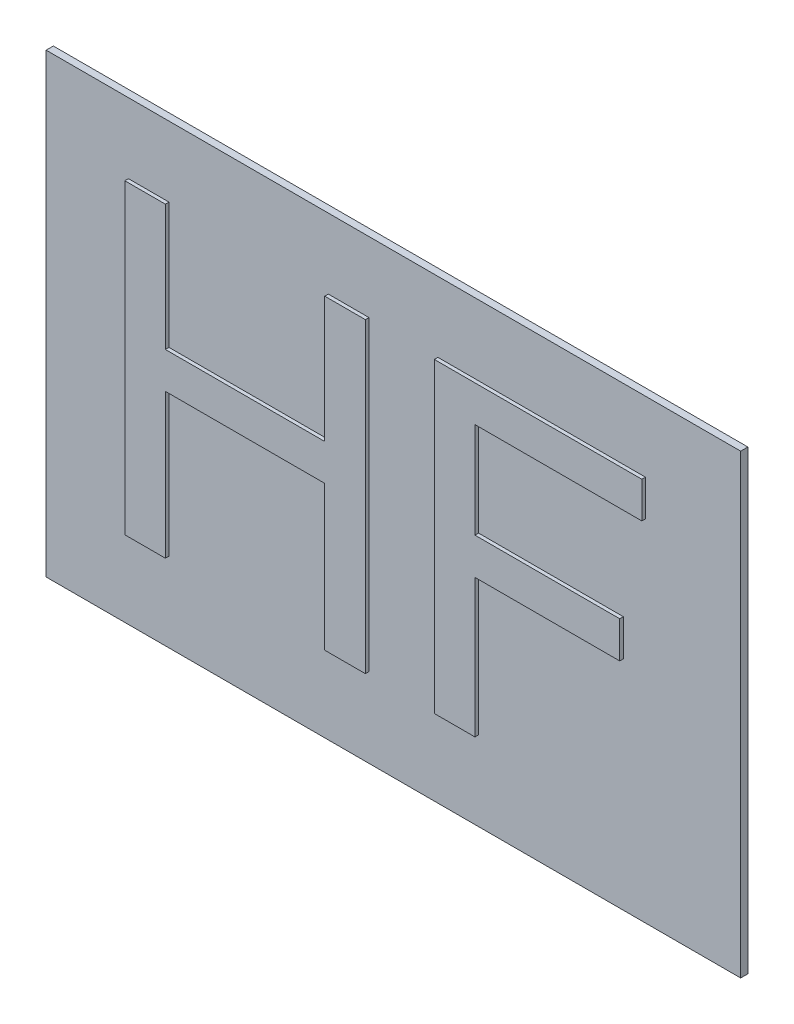
ISO-10303-21;
HEADER;
FILE_DESCRIPTION(('STEP AP214'),'2;1');
FILE_NAME('part.step','',(''),(''),'','','');
FILE_SCHEMA(('AUTOMOTIVE_DESIGN { 1 0 10303 214 1 1 1 1 }'));
ENDSEC;
DATA;
#1=APPLICATION_CONTEXT('core data for automotive mechanical design processes');
#2=APPLICATION_PROTOCOL_DEFINITION('international standard','automotive_design',2000,#1);
#3=PRODUCT_CONTEXT('',#1,'mechanical');
#4=PRODUCT('Part','Part','',(#3));
#5=PRODUCT_RELATED_PRODUCT_CATEGORY('part','',(#4));
#6=PRODUCT_DEFINITION_FORMATION('','',#4);
#7=PRODUCT_DEFINITION_CONTEXT('part definition',#1,'design');
#8=PRODUCT_DEFINITION('design','',#6,#7);
#9=PRODUCT_DEFINITION_SHAPE('','',#8);
#10=(LENGTH_UNIT() NAMED_UNIT(*) SI_UNIT(.MILLI.,.METRE.));
#11=(NAMED_UNIT(*) PLANE_ANGLE_UNIT() SI_UNIT($,.RADIAN.));
#12=(NAMED_UNIT(*) SI_UNIT($,.STERADIAN.) SOLID_ANGLE_UNIT());
#13=UNCERTAINTY_MEASURE_WITH_UNIT(LENGTH_MEASURE(1.E-05),#10,'distance_accuracy_value','');
#14=(GEOMETRIC_REPRESENTATION_CONTEXT(3) GLOBAL_UNCERTAINTY_ASSIGNED_CONTEXT((#13)) GLOBAL_UNIT_ASSIGNED_CONTEXT((#10,
#11,#12)) REPRESENTATION_CONTEXT('',''));
#15=CARTESIAN_POINT('',(0.,0.,0.));
#16=DIRECTION('',(0.,0.,1.));
#17=DIRECTION('',(1.,0.,0.));
#18=AXIS2_PLACEMENT_3D('',#15,#16,#17);
#19=CARTESIAN_POINT('',(1.8974,2.6195,0.05));
#20=DIRECTION('',(-1.,0.,0.));
#21=DIRECTION('',(0.,0.,1.));
#22=AXIS2_PLACEMENT_3D('',#19,#20,#21);
#23=PLANE('',#22);
#24=DIRECTION('',(0.,0.,1.));
#25=VECTOR('',#24,1.);
#26=CARTESIAN_POINT('',(1.8974,1.745,0.05));
#27=LINE('',#26,#25);
#28=CARTESIAN_POINT('',(1.8974,1.745,0.05));
#29=VERTEX_POINT('',#28);
#30=CARTESIAN_POINT('',(1.8974,1.745,0.075));
#31=VERTEX_POINT('',#30);
#32=EDGE_CURVE('E11',#29,#31,#27,.T.);
#33=ORIENTED_EDGE('',*,*,#32,.T.);
#34=DIRECTION('',(0.,-1.,0.));
#35=VECTOR('',#34,1.);
#36=CARTESIAN_POINT('',(1.8974,2.6195,0.075));
#37=LINE('',#36,#35);
#38=CARTESIAN_POINT('',(1.8974,2.6195,0.075));
#39=VERTEX_POINT('',#38);
#40=EDGE_CURVE('E313',#39,#31,#37,.T.);
#41=ORIENTED_EDGE('',*,*,#40,.F.);
#42=DIRECTION('',(0.,0.,1.));
#43=VECTOR('',#42,1.);
#44=CARTESIAN_POINT('',(1.8974,2.6195,0.05));
#45=LINE('',#44,#43);
#46=CARTESIAN_POINT('',(1.8974,2.6195,0.05));
#47=VERTEX_POINT('',#46);
#48=EDGE_CURVE('E333',#47,#39,#45,.T.);
#49=ORIENTED_EDGE('',*,*,#48,.F.);
#50=DIRECTION('',(0.,-1.,0.));
#51=VECTOR('',#50,1.);
#52=CARTESIAN_POINT('',(1.8974,2.6195,0.05));
#53=LINE('',#52,#51);
#54=EDGE_CURVE('E290',#47,#29,#53,.T.);
#55=ORIENTED_EDGE('',*,*,#54,.T.);
#56=EDGE_LOOP('',(#33,#41,#49,#55));
#57=FACE_BOUND('',#56,.T.);
#58=ADVANCED_FACE('F17',(#57),#23,.T.);
#59=CARTESIAN_POINT('',(1.8974,1.745,0.05));
#60=DIRECTION('',(0.,1.,0.));
#61=DIRECTION('',(1.,0.,0.));
#62=AXIS2_PLACEMENT_3D('',#59,#60,#61);
#63=PLANE('',#62);
#64=DIRECTION('',(0.,0.,1.));
#65=VECTOR('',#64,1.);
#66=CARTESIAN_POINT('',(0.7902,1.745,0.05));
#67=LINE('',#66,#65);
#68=CARTESIAN_POINT('',(0.7902,1.745,0.05));
#69=VERTEX_POINT('',#68);
#70=CARTESIAN_POINT('',(0.7902,1.745,0.075));
#71=VERTEX_POINT('',#70);
#72=EDGE_CURVE('E28',#69,#71,#67,.T.);
#73=ORIENTED_EDGE('',*,*,#72,.T.);
#74=DIRECTION('',(-1.,0.,0.));
#75=VECTOR('',#74,1.);
#76=CARTESIAN_POINT('',(1.8974,1.745,0.075));
#77=LINE('',#76,#75);
#78=EDGE_CURVE('E384',#31,#71,#77,.T.);
#79=ORIENTED_EDGE('',*,*,#78,.F.);
#80=ORIENTED_EDGE('',*,*,#32,.F.);
#81=DIRECTION('',(-1.,0.,0.));
#82=VECTOR('',#81,1.);
#83=CARTESIAN_POINT('',(1.8974,1.745,0.05));
#84=LINE('',#83,#82);
#85=EDGE_CURVE('E294',#29,#69,#84,.T.);
#86=ORIENTED_EDGE('',*,*,#85,.T.);
#87=EDGE_LOOP('',(#73,#79,#80,#86));
#88=FACE_BOUND('',#87,.T.);
#89=ADVANCED_FACE('F625',(#88),#63,.T.);
#90=CARTESIAN_POINT('',(0.7902,1.745,0.05));
#91=DIRECTION('',(1.,0.,0.));
#92=DIRECTION('',(0.,1.,0.));
#93=AXIS2_PLACEMENT_3D('',#90,#91,#92);
#94=PLANE('',#93);
#95=DIRECTION('',(0.,0.,1.));
#96=VECTOR('',#95,1.);
#97=CARTESIAN_POINT('',(0.7902,2.6195,0.05));
#98=LINE('',#97,#96);
#99=CARTESIAN_POINT('',(0.7902,2.6195,0.05));
#100=VERTEX_POINT('',#99);
#101=CARTESIAN_POINT('',(0.7902,2.6195,0.075));
#102=VERTEX_POINT('',#101);
#103=EDGE_CURVE('E326',#100,#102,#98,.T.);
#104=ORIENTED_EDGE('',*,*,#103,.T.);
#105=DIRECTION('',(0.,1.,0.));
#106=VECTOR('',#105,1.);
#107=CARTESIAN_POINT('',(0.7902,1.745,0.075));
#108=LINE('',#107,#106);
#109=EDGE_CURVE('E396',#71,#102,#108,.T.);
#110=ORIENTED_EDGE('',*,*,#109,.F.);
#111=ORIENTED_EDGE('',*,*,#72,.F.);
#112=DIRECTION('',(0.,1.,0.));
#113=VECTOR('',#112,1.);
#114=CARTESIAN_POINT('',(0.7902,1.745,0.05));
#115=LINE('',#114,#113);
#116=EDGE_CURVE('E276',#69,#100,#115,.T.);
#117=ORIENTED_EDGE('',*,*,#116,.T.);
#118=EDGE_LOOP('',(#104,#110,#111,#117));
#119=FACE_BOUND('',#118,.T.);
#120=ADVANCED_FACE('F513',(#119),#94,.T.);
#121=CARTESIAN_POINT('',(0.7902,2.6195,0.05));
#122=DIRECTION('',(0.,1.,0.));
#123=DIRECTION('',(1.,0.,0.));
#124=AXIS2_PLACEMENT_3D('',#121,#122,#123);
#125=PLANE('',#124);
#126=DIRECTION('',(0.,0.,1.));
#127=VECTOR('',#126,1.);
#128=CARTESIAN_POINT('',(0.5083,2.6195,0.05));
#129=LINE('',#128,#127);
#130=CARTESIAN_POINT('',(0.5083,2.6195,0.05));
#131=VERTEX_POINT('',#130);
#132=CARTESIAN_POINT('',(0.5083,2.6195,0.075));
#133=VERTEX_POINT('',#132);
#134=EDGE_CURVE('E438',#131,#133,#129,.T.);
#135=ORIENTED_EDGE('',*,*,#134,.T.);
#136=DIRECTION('',(-1.,0.,0.));
#137=VECTOR('',#136,1.);
#138=CARTESIAN_POINT('',(0.7902,2.6195,0.075));
#139=LINE('',#138,#137);
#140=EDGE_CURVE('E406',#102,#133,#139,.T.);
#141=ORIENTED_EDGE('',*,*,#140,.F.);
#142=ORIENTED_EDGE('',*,*,#103,.F.);
#143=DIRECTION('',(-1.,0.,0.));
#144=VECTOR('',#143,1.);
#145=CARTESIAN_POINT('',(0.7902,2.6195,0.05));
#146=LINE('',#145,#144);
#147=EDGE_CURVE('E273',#100,#131,#146,.T.);
#148=ORIENTED_EDGE('',*,*,#147,.T.);
#149=EDGE_LOOP('',(#135,#141,#142,#148));
#150=FACE_BOUND('',#149,.T.);
#151=ADVANCED_FACE('F503',(#150),#125,.T.);
#152=CARTESIAN_POINT('',(0.5083,2.6195,0.05));
#153=DIRECTION('',(-1.,0.,0.));
#154=DIRECTION('',(0.,0.,1.));
#155=AXIS2_PLACEMENT_3D('',#152,#153,#154);
#156=PLANE('',#155);
#157=DIRECTION('',(0.,0.,1.));
#158=VECTOR('',#157,1.);
#159=CARTESIAN_POINT('',(0.5083,0.4889,0.05));
#160=LINE('',#159,#158);
#161=CARTESIAN_POINT('',(0.5083,0.4889,0.05));
#162=VERTEX_POINT('',#161);
#163=CARTESIAN_POINT('',(0.5083,0.4889,0.075));
#164=VERTEX_POINT('',#163);
#165=EDGE_CURVE('E435',#162,#164,#160,.T.);
#166=ORIENTED_EDGE('',*,*,#165,.T.);
#167=DIRECTION('',(0.,-1.,0.));
#168=VECTOR('',#167,1.);
#169=CARTESIAN_POINT('',(0.5083,2.6195,0.075));
#170=LINE('',#169,#168);
#171=EDGE_CURVE('E402',#133,#164,#170,.T.);
#172=ORIENTED_EDGE('',*,*,#171,.F.);
#173=ORIENTED_EDGE('',*,*,#134,.F.);
#174=DIRECTION('',(0.,-1.,0.));
#175=VECTOR('',#174,1.);
#176=CARTESIAN_POINT('',(0.5083,2.6195,0.05));
#177=LINE('',#176,#175);
#178=EDGE_CURVE('E277',#131,#162,#177,.T.);
#179=ORIENTED_EDGE('',*,*,#178,.T.);
#180=EDGE_LOOP('',(#166,#172,#173,#179));
#181=FACE_BOUND('',#180,.T.);
#182=ADVANCED_FACE('F523',(#181),#156,.T.);
#183=CARTESIAN_POINT('',(0.5083,0.4889,0.05));
#184=DIRECTION('',(0.,-1.,0.));
#185=DIRECTION('',(0.,0.,-1.));
#186=AXIS2_PLACEMENT_3D('',#183,#184,#185);
#187=PLANE('',#186);
#188=DIRECTION('',(0.,0.,1.));
#189=VECTOR('',#188,1.);
#190=CARTESIAN_POINT('',(0.7902,0.4889,0.05));
#191=LINE('',#190,#189);
#192=CARTESIAN_POINT('',(0.7902,0.4889,0.05));
#193=VERTEX_POINT('',#192);
#194=CARTESIAN_POINT('',(0.7902,0.4889,0.075));
#195=VERTEX_POINT('',#194);
#196=EDGE_CURVE('E192',#193,#195,#191,.T.);
#197=ORIENTED_EDGE('',*,*,#196,.T.);
#198=DIRECTION('',(1.,0.,0.));
#199=VECTOR('',#198,1.);
#200=CARTESIAN_POINT('',(0.5083,0.4889,0.075));
#201=LINE('',#200,#199);
#202=EDGE_CURVE('E370',#164,#195,#201,.T.);
#203=ORIENTED_EDGE('',*,*,#202,.F.);
#204=ORIENTED_EDGE('',*,*,#165,.F.);
#205=DIRECTION('',(1.,0.,0.));
#206=VECTOR('',#205,1.);
#207=CARTESIAN_POINT('',(0.5083,0.4889,0.05));
#208=LINE('',#207,#206);
#209=EDGE_CURVE('E298',#162,#193,#208,.T.);
#210=ORIENTED_EDGE('',*,*,#209,.T.);
#211=EDGE_LOOP('',(#197,#203,#204,#210));
#212=FACE_BOUND('',#211,.T.);
#213=ADVANCED_FACE('F1259',(#212),#187,.T.);
#214=CARTESIAN_POINT('',(0.7902,0.4889,0.05));
#215=DIRECTION('',(1.,0.,0.));
#216=DIRECTION('',(0.,1.,0.));
#217=AXIS2_PLACEMENT_3D('',#214,#215,#216);
#218=PLANE('',#217);
#219=DIRECTION('',(0.,0.,1.));
#220=VECTOR('',#219,1.);
#221=CARTESIAN_POINT('',(0.7902,1.493,0.05));
#222=LINE('',#221,#220);
#223=CARTESIAN_POINT('',(0.7902,1.493,0.05));
#224=VERTEX_POINT('',#223);
#225=CARTESIAN_POINT('',(0.7902,1.493,0.075));
#226=VERTEX_POINT('',#225);
#227=EDGE_CURVE('E176',#224,#226,#222,.T.);
#228=ORIENTED_EDGE('',*,*,#227,.T.);
#229=DIRECTION('',(0.,1.,0.));
#230=VECTOR('',#229,1.);
#231=CARTESIAN_POINT('',(0.7902,0.4889,0.075));
#232=LINE('',#231,#230);
#233=EDGE_CURVE('E332',#195,#226,#232,.T.);
#234=ORIENTED_EDGE('',*,*,#233,.F.);
#235=ORIENTED_EDGE('',*,*,#196,.F.);
#236=DIRECTION('',(0.,1.,0.));
#237=VECTOR('',#236,1.);
#238=CARTESIAN_POINT('',(0.7902,0.4889,0.05));
#239=LINE('',#238,#237);
#240=EDGE_CURVE('E295',#193,#224,#239,.T.);
#241=ORIENTED_EDGE('',*,*,#240,.T.);
#242=EDGE_LOOP('',(#228,#234,#235,#241));
#243=FACE_BOUND('',#242,.T.);
#244=ADVANCED_FACE('F1269',(#243),#218,.T.);
#245=CARTESIAN_POINT('',(0.7902,1.493,0.05));
#246=DIRECTION('',(0.,-1.,0.));
#247=DIRECTION('',(0.,0.,-1.));
#248=AXIS2_PLACEMENT_3D('',#245,#246,#247);
#249=PLANE('',#248);
#250=DIRECTION('',(0.,0.,1.));
#251=VECTOR('',#250,1.);
#252=CARTESIAN_POINT('',(1.8974,1.493,0.05));
#253=LINE('',#252,#251);
#254=CARTESIAN_POINT('',(1.8974,1.493,0.05));
#255=VERTEX_POINT('',#254);
#256=CARTESIAN_POINT('',(1.8974,1.493,0.075));
#257=VERTEX_POINT('',#256);
#258=EDGE_CURVE('E363',#255,#257,#253,.T.);
#259=ORIENTED_EDGE('',*,*,#258,.T.);
#260=DIRECTION('',(1.,0.,0.));
#261=VECTOR('',#260,1.);
#262=CARTESIAN_POINT('',(0.7902,1.493,0.075));
#263=LINE('',#262,#261);
#264=EDGE_CURVE('E327',#226,#257,#263,.T.);
#265=ORIENTED_EDGE('',*,*,#264,.F.);
#266=ORIENTED_EDGE('',*,*,#227,.F.);
#267=DIRECTION('',(1.,0.,0.));
#268=VECTOR('',#267,1.);
#269=CARTESIAN_POINT('',(0.7902,1.493,0.05));
#270=LINE('',#269,#268);
#271=EDGE_CURVE('E299',#224,#255,#270,.T.);
#272=ORIENTED_EDGE('',*,*,#271,.T.);
#273=EDGE_LOOP('',(#259,#265,#266,#272));
#274=FACE_BOUND('',#273,.T.);
#275=ADVANCED_FACE('F1280',(#274),#249,.T.);
#276=CARTESIAN_POINT('',(1.8974,1.493,0.05));
#277=DIRECTION('',(-1.,0.,0.));
#278=DIRECTION('',(0.,0.,1.));
#279=AXIS2_PLACEMENT_3D('',#276,#277,#278);
#280=PLANE('',#279);
#281=DIRECTION('',(0.,0.,1.));
#282=VECTOR('',#281,1.);
#283=CARTESIAN_POINT('',(1.8974,0.4889,0.05));
#284=LINE('',#283,#282);
#285=CARTESIAN_POINT('',(1.8974,0.4889,0.05));
#286=VERTEX_POINT('',#285);
#287=CARTESIAN_POINT('',(1.8974,0.4889,0.075));
#288=VERTEX_POINT('',#287);
#289=EDGE_CURVE('E373',#286,#288,#284,.T.);
#290=ORIENTED_EDGE('',*,*,#289,.T.);
#291=DIRECTION('',(0.,-1.,0.));
#292=VECTOR('',#291,1.);
#293=CARTESIAN_POINT('',(1.8974,1.493,0.075));
#294=LINE('',#293,#292);
#295=EDGE_CURVE('E331',#257,#288,#294,.T.);
#296=ORIENTED_EDGE('',*,*,#295,.F.);
#297=ORIENTED_EDGE('',*,*,#258,.F.);
#298=DIRECTION('',(0.,-1.,0.));
#299=VECTOR('',#298,1.);
#300=CARTESIAN_POINT('',(1.8974,1.493,0.05));
#301=LINE('',#300,#299);
#302=EDGE_CURVE('E305',#255,#286,#301,.T.);
#303=ORIENTED_EDGE('',*,*,#302,.T.);
#304=EDGE_LOOP('',(#290,#296,#297,#303));
#305=FACE_BOUND('',#304,.T.);
#306=ADVANCED_FACE('F1290',(#305),#280,.T.);
#307=CARTESIAN_POINT('',(1.8974,0.4889,0.05));
#308=DIRECTION('',(0.,-1.,0.));
#309=DIRECTION('',(0.,0.,-1.));
#310=AXIS2_PLACEMENT_3D('',#307,#308,#309);
#311=PLANE('',#310);
#312=DIRECTION('',(0.,0.,1.));
#313=VECTOR('',#312,1.);
#314=CARTESIAN_POINT('',(2.1798,0.4889,0.05));
#315=LINE('',#314,#313);
#316=CARTESIAN_POINT('',(2.1798,0.4889,0.05));
#317=VERTEX_POINT('',#316);
#318=CARTESIAN_POINT('',(2.1798,0.4889,0.075));
#319=VERTEX_POINT('',#318);
#320=EDGE_CURVE('E371',#317,#319,#315,.T.);
#321=ORIENTED_EDGE('',*,*,#320,.T.);
#322=DIRECTION('',(1.,0.,0.));
#323=VECTOR('',#322,1.);
#324=CARTESIAN_POINT('',(1.8974,0.4889,0.075));
#325=LINE('',#324,#323);
#326=EDGE_CURVE('E445',#288,#319,#325,.T.);
#327=ORIENTED_EDGE('',*,*,#326,.F.);
#328=ORIENTED_EDGE('',*,*,#289,.F.);
#329=DIRECTION('',(1.,0.,0.));
#330=VECTOR('',#329,1.);
#331=CARTESIAN_POINT('',(1.8974,0.4889,0.05));
#332=LINE('',#331,#330);
#333=EDGE_CURVE('E309',#286,#317,#332,.T.);
#334=ORIENTED_EDGE('',*,*,#333,.T.);
#335=EDGE_LOOP('',(#321,#327,#328,#334));
#336=FACE_BOUND('',#335,.T.);
#337=ADVANCED_FACE('F19',(#336),#311,.T.);
#338=CARTESIAN_POINT('',(2.1798,0.4889,0.05));
#339=DIRECTION('',(1.,0.,0.));
#340=DIRECTION('',(0.,1.,0.));
#341=AXIS2_PLACEMENT_3D('',#338,#339,#340);
#342=PLANE('',#341);
#343=DIRECTION('',(0.,0.,1.));
#344=VECTOR('',#343,1.);
#345=CARTESIAN_POINT('',(2.1798,2.6195,0.05));
#346=LINE('',#345,#344);
#347=CARTESIAN_POINT('',(2.1798,2.6195,0.05));
#348=VERTEX_POINT('',#347);
#349=CARTESIAN_POINT('',(2.1798,2.6195,0.075));
#350=VERTEX_POINT('',#349);
#351=EDGE_CURVE('E42',#348,#350,#346,.T.);
#352=ORIENTED_EDGE('',*,*,#351,.T.);
#353=DIRECTION('',(0.,1.,0.));
#354=VECTOR('',#353,1.);
#355=CARTESIAN_POINT('',(2.1798,0.4889,0.075));
#356=LINE('',#355,#354);
#357=EDGE_CURVE('E271',#319,#350,#356,.T.);
#358=ORIENTED_EDGE('',*,*,#357,.F.);
#359=ORIENTED_EDGE('',*,*,#320,.F.);
#360=DIRECTION('',(0.,1.,0.));
#361=VECTOR('',#360,1.);
#362=CARTESIAN_POINT('',(2.1798,0.4889,0.05));
#363=LINE('',#362,#361);
#364=EDGE_CURVE('E341',#317,#348,#363,.T.);
#365=ORIENTED_EDGE('',*,*,#364,.T.);
#366=EDGE_LOOP('',(#352,#358,#359,#365));
#367=FACE_BOUND('',#366,.T.);
#368=ADVANCED_FACE('F559',(#367),#342,.T.);
#369=CARTESIAN_POINT('',(2.1798,2.6195,0.05));
#370=DIRECTION('',(0.,1.,0.));
#371=DIRECTION('',(1.,0.,0.));
#372=AXIS2_PLACEMENT_3D('',#369,#370,#371);
#373=PLANE('',#372);
#374=ORIENTED_EDGE('',*,*,#48,.T.);
#375=DIRECTION('',(-1.,0.,0.));
#376=VECTOR('',#375,1.);
#377=CARTESIAN_POINT('',(2.1798,2.6195,0.075));
#378=LINE('',#377,#376);
#379=EDGE_CURVE('E336',#350,#39,#378,.T.);
#380=ORIENTED_EDGE('',*,*,#379,.F.);
#381=ORIENTED_EDGE('',*,*,#351,.F.);
#382=DIRECTION('',(-1.,0.,0.));
#383=VECTOR('',#382,1.);
#384=CARTESIAN_POINT('',(2.1798,2.6195,0.05));
#385=LINE('',#384,#383);
#386=EDGE_CURVE('E283',#348,#47,#385,.T.);
#387=ORIENTED_EDGE('',*,*,#386,.T.);
#388=EDGE_LOOP('',(#374,#380,#381,#387));
#389=FACE_BOUND('',#388,.T.);
#390=ADVANCED_FACE('F1207',(#389),#373,.T.);
#391=CARTESIAN_POINT('',(0.,0.,0.075));
#392=DIRECTION('',(0.,0.,1.));
#393=DIRECTION('',(1.,0.,0.));
#394=AXIS2_PLACEMENT_3D('',#391,#392,#393);
#395=PLANE('',#394);
#396=ORIENTED_EDGE('',*,*,#40,.T.);
#397=ORIENTED_EDGE('',*,*,#78,.T.);
#398=ORIENTED_EDGE('',*,*,#109,.T.);
#399=ORIENTED_EDGE('',*,*,#140,.T.);
#400=ORIENTED_EDGE('',*,*,#171,.T.);
#401=ORIENTED_EDGE('',*,*,#202,.T.);
#402=ORIENTED_EDGE('',*,*,#233,.T.);
#403=ORIENTED_EDGE('',*,*,#264,.T.);
#404=ORIENTED_EDGE('',*,*,#295,.T.);
#405=ORIENTED_EDGE('',*,*,#326,.T.);
#406=ORIENTED_EDGE('',*,*,#357,.T.);
#407=ORIENTED_EDGE('',*,*,#379,.T.);
#408=EDGE_LOOP('',(#396,#397,#398,#399,#400,#401,#402,#403,#404,#405,#406,#407));
#409=FACE_BOUND('',#408,.T.);
#410=ADVANCED_FACE('F556',(#409),#395,.T.);
#411=CARTESIAN_POINT('',(0.,0.,0.075));
#412=DIRECTION('',(0.,0.,1.));
#413=DIRECTION('',(1.,0.,0.));
#414=AXIS2_PLACEMENT_3D('',#411,#412,#413);
#415=PLANE('',#414);
#416=DIRECTION('',(1.,0.,0.));
#417=VECTOR('',#416,1.);
#418=CARTESIAN_POINT('',(2.9413,1.4491,0.075));
#419=LINE('',#418,#417);
#420=CARTESIAN_POINT('',(2.9413,1.4491,0.075));
#421=VERTEX_POINT('',#420);
#422=CARTESIAN_POINT('',(3.9469,1.4491,0.075));
#423=VERTEX_POINT('',#422);
#424=EDGE_CURVE('E310',#421,#423,#419,.T.);
#425=ORIENTED_EDGE('',*,*,#424,.T.);
#426=DIRECTION('',(0.,1.,0.));
#427=VECTOR('',#426,1.);
#428=CARTESIAN_POINT('',(3.9469,1.4491,0.075));
#429=LINE('',#428,#427);
#430=CARTESIAN_POINT('',(3.9469,1.7031,0.075));
#431=VERTEX_POINT('',#430);
#432=EDGE_CURVE('E323',#423,#431,#429,.T.);
#433=ORIENTED_EDGE('',*,*,#432,.T.);
#434=DIRECTION('',(-1.,0.,0.));
#435=VECTOR('',#434,1.);
#436=CARTESIAN_POINT('',(3.9469,1.7031,0.075));
#437=LINE('',#436,#435);
#438=CARTESIAN_POINT('',(2.9413,1.7031,0.075));
#439=VERTEX_POINT('',#438);
#440=EDGE_CURVE('E434',#431,#439,#437,.T.);
#441=ORIENTED_EDGE('',*,*,#440,.T.);
#442=DIRECTION('',(0.,1.,0.));
#443=VECTOR('',#442,1.);
#444=CARTESIAN_POINT('',(2.9413,1.7031,0.075));
#445=LINE('',#444,#443);
#446=CARTESIAN_POINT('',(2.9413,2.3686,0.075));
#447=VERTEX_POINT('',#446);
#448=EDGE_CURVE('E240',#439,#447,#445,.T.);
#449=ORIENTED_EDGE('',*,*,#448,.T.);
#450=DIRECTION('',(1.,0.,0.));
#451=VECTOR('',#450,1.);
#452=CARTESIAN_POINT('',(2.9413,2.3686,0.075));
#453=LINE('',#452,#451);
#454=CARTESIAN_POINT('',(4.1008,2.3686,0.075));
#455=VERTEX_POINT('',#454);
#456=EDGE_CURVE('E233',#447,#455,#453,.T.);
#457=ORIENTED_EDGE('',*,*,#456,.T.);
#458=DIRECTION('',(0.,1.,0.));
#459=VECTOR('',#458,1.);
#460=CARTESIAN_POINT('',(4.1008,2.3686,0.075));
#461=LINE('',#460,#459);
#462=CARTESIAN_POINT('',(4.1008,2.6195,0.075));
#463=VERTEX_POINT('',#462);
#464=EDGE_CURVE('E237',#455,#463,#461,.T.);
#465=ORIENTED_EDGE('',*,*,#464,.T.);
#466=DIRECTION('',(-1.,0.,0.));
#467=VECTOR('',#466,1.);
#468=CARTESIAN_POINT('',(4.1008,2.6195,0.075));
#469=LINE('',#468,#467);
#470=CARTESIAN_POINT('',(2.6586,2.6195,0.075));
#471=VERTEX_POINT('',#470);
#472=EDGE_CURVE('E267',#463,#471,#469,.T.);
#473=ORIENTED_EDGE('',*,*,#472,.T.);
#474=DIRECTION('',(0.,-1.,0.));
#475=VECTOR('',#474,1.);
#476=CARTESIAN_POINT('',(2.6586,2.6195,0.075));
#477=LINE('',#476,#475);
#478=CARTESIAN_POINT('',(2.6586,0.4889,0.075));
#479=VERTEX_POINT('',#478);
#480=EDGE_CURVE('E304',#471,#479,#477,.T.);
#481=ORIENTED_EDGE('',*,*,#480,.T.);
#482=DIRECTION('',(1.,0.,0.));
#483=VECTOR('',#482,1.);
#484=CARTESIAN_POINT('',(2.6586,0.4889,0.075));
#485=LINE('',#484,#483);
#486=CARTESIAN_POINT('',(2.9413,0.4889,0.075));
#487=VERTEX_POINT('',#486);
#488=EDGE_CURVE('E385',#479,#487,#485,.T.);
#489=ORIENTED_EDGE('',*,*,#488,.T.);
#490=DIRECTION('',(0.,1.,0.));
#491=VECTOR('',#490,1.);
#492=CARTESIAN_POINT('',(2.9413,0.4889,0.075));
#493=LINE('',#492,#491);
#494=EDGE_CURVE('E282',#487,#421,#493,.T.);
#495=ORIENTED_EDGE('',*,*,#494,.T.);
#496=EDGE_LOOP('',(#425,#433,#441,#449,#457,#465,#473,#481,#489,#495));
#497=FACE_BOUND('',#496,.T.);
#498=ADVANCED_FACE('F235',(#497),#415,.T.);
#499=CARTESIAN_POINT('',(2.9413,1.4491,0.05));
#500=DIRECTION('',(0.,-1.,0.));
#501=DIRECTION('',(0.,0.,-1.));
#502=AXIS2_PLACEMENT_3D('',#499,#500,#501);
#503=PLANE('',#502);
#504=DIRECTION('',(0.,0.,1.));
#505=VECTOR('',#504,1.);
#506=CARTESIAN_POINT('',(3.9469,1.4491,0.05));
#507=LINE('',#506,#505);
#508=CARTESIAN_POINT('',(3.9469,1.4491,0.05));
#509=VERTEX_POINT('',#508);
#510=EDGE_CURVE('E314',#509,#423,#507,.T.);
#511=ORIENTED_EDGE('',*,*,#510,.T.);
#512=ORIENTED_EDGE('',*,*,#424,.F.);
#513=DIRECTION('',(0.,0.,1.));
#514=VECTOR('',#513,1.);
#515=CARTESIAN_POINT('',(2.9413,1.4491,0.05));
#516=LINE('',#515,#514);
#517=CARTESIAN_POINT('',(2.9413,1.4491,0.05));
#518=VERTEX_POINT('',#517);
#519=EDGE_CURVE('E278',#518,#421,#516,.T.);
#520=ORIENTED_EDGE('',*,*,#519,.F.);
#521=DIRECTION('',(1.,0.,0.));
#522=VECTOR('',#521,1.);
#523=CARTESIAN_POINT('',(2.9413,1.4491,0.05));
#524=LINE('',#523,#522);
#525=EDGE_CURVE('E342',#518,#509,#524,.T.);
#526=ORIENTED_EDGE('',*,*,#525,.T.);
#527=EDGE_LOOP('',(#511,#512,#520,#526));
#528=FACE_BOUND('',#527,.T.);
#529=ADVANCED_FACE('F467',(#528),#503,.T.);
#530=CARTESIAN_POINT('',(3.9469,1.4491,0.05));
#531=DIRECTION('',(1.,0.,0.));
#532=DIRECTION('',(0.,1.,0.));
#533=AXIS2_PLACEMENT_3D('',#530,#531,#532);
#534=PLANE('',#533);
#535=DIRECTION('',(0.,0.,1.));
#536=VECTOR('',#535,1.);
#537=CARTESIAN_POINT('',(3.9469,1.7031,0.05));
#538=LINE('',#537,#536);
#539=CARTESIAN_POINT('',(3.9469,1.7031,0.05));
#540=VERTEX_POINT('',#539);
#541=EDGE_CURVE('E425',#540,#431,#538,.T.);
#542=ORIENTED_EDGE('',*,*,#541,.T.);
#543=ORIENTED_EDGE('',*,*,#432,.F.);
#544=ORIENTED_EDGE('',*,*,#510,.F.);
#545=DIRECTION('',(0.,1.,0.));
#546=VECTOR('',#545,1.);
#547=CARTESIAN_POINT('',(3.9469,1.4491,0.05));
#548=LINE('',#547,#546);
#549=EDGE_CURVE('E378',#509,#540,#548,.T.);
#550=ORIENTED_EDGE('',*,*,#549,.T.);
#551=EDGE_LOOP('',(#542,#543,#544,#550));
#552=FACE_BOUND('',#551,.T.);
#553=ADVANCED_FACE('F479',(#552),#534,.T.);
#554=CARTESIAN_POINT('',(3.9469,1.7031,0.05));
#555=DIRECTION('',(0.,1.,0.));
#556=DIRECTION('',(1.,0.,0.));
#557=AXIS2_PLACEMENT_3D('',#554,#555,#556);
#558=PLANE('',#557);
#559=DIRECTION('',(0.,0.,1.));
#560=VECTOR('',#559,1.);
#561=CARTESIAN_POINT('',(2.9413,1.7031,0.05));
#562=LINE('',#561,#560);
#563=CARTESIAN_POINT('',(2.9413,1.7031,0.05));
#564=VERTEX_POINT('',#563);
#565=EDGE_CURVE('E392',#564,#439,#562,.T.);
#566=ORIENTED_EDGE('',*,*,#565,.T.);
#567=ORIENTED_EDGE('',*,*,#440,.F.);
#568=ORIENTED_EDGE('',*,*,#541,.F.);
#569=DIRECTION('',(-1.,0.,0.));
#570=VECTOR('',#569,1.);
#571=CARTESIAN_POINT('',(3.9469,1.7031,0.05));
#572=LINE('',#571,#570);
#573=EDGE_CURVE('E375',#540,#564,#572,.T.);
#574=ORIENTED_EDGE('',*,*,#573,.T.);
#575=EDGE_LOOP('',(#566,#567,#568,#574));
#576=FACE_BOUND('',#575,.T.);
#577=ADVANCED_FACE('F1336',(#576),#558,.T.);
#578=CARTESIAN_POINT('',(2.9413,1.7031,0.05));
#579=DIRECTION('',(1.,0.,0.));
#580=DIRECTION('',(0.,1.,0.));
#581=AXIS2_PLACEMENT_3D('',#578,#579,#580);
#582=PLANE('',#581);
#583=DIRECTION('',(0.,0.,1.));
#584=VECTOR('',#583,1.);
#585=CARTESIAN_POINT('',(2.9413,2.3686,0.05));
#586=LINE('',#585,#584);
#587=CARTESIAN_POINT('',(2.9413,2.3686,0.05));
#588=VERTEX_POINT('',#587);
#589=EDGE_CURVE('E244',#588,#447,#586,.T.);
#590=ORIENTED_EDGE('',*,*,#589,.T.);
#591=ORIENTED_EDGE('',*,*,#448,.F.);
#592=ORIENTED_EDGE('',*,*,#565,.F.);
#593=DIRECTION('',(0.,1.,0.));
#594=VECTOR('',#593,1.);
#595=CARTESIAN_POINT('',(2.9413,1.7031,0.05));
#596=LINE('',#595,#594);
#597=EDGE_CURVE('E379',#564,#588,#596,.T.);
#598=ORIENTED_EDGE('',*,*,#597,.T.);
#599=EDGE_LOOP('',(#590,#591,#592,#598));
#600=FACE_BOUND('',#599,.T.);
#601=ADVANCED_FACE('F599',(#600),#582,.T.);
#602=CARTESIAN_POINT('',(2.9413,2.3686,0.05));
#603=DIRECTION('',(0.,-1.,0.));
#604=DIRECTION('',(0.,0.,-1.));
#605=AXIS2_PLACEMENT_3D('',#602,#603,#604);
#606=PLANE('',#605);
#607=DIRECTION('',(0.,0.,1.));
#608=VECTOR('',#607,1.);
#609=CARTESIAN_POINT('',(4.1008,2.3686,0.05));
#610=LINE('',#609,#608);
#611=CARTESIAN_POINT('',(4.1008,2.3686,0.05));
#612=VERTEX_POINT('',#611);
#613=EDGE_CURVE('E245',#612,#455,#610,.T.);
#614=ORIENTED_EDGE('',*,*,#613,.T.);
#615=ORIENTED_EDGE('',*,*,#456,.F.);
#616=ORIENTED_EDGE('',*,*,#589,.F.);
#617=DIRECTION('',(1.,0.,0.));
#618=VECTOR('',#617,1.);
#619=CARTESIAN_POINT('',(2.9413,2.3686,0.05));
#620=LINE('',#619,#618);
#621=EDGE_CURVE('E250',#588,#612,#620,.T.);
#622=ORIENTED_EDGE('',*,*,#621,.T.);
#623=EDGE_LOOP('',(#614,#615,#616,#622));
#624=FACE_BOUND('',#623,.T.);
#625=ADVANCED_FACE('F248',(#624),#606,.T.);
#626=CARTESIAN_POINT('',(4.1008,2.3686,0.05));
#627=DIRECTION('',(1.,0.,0.));
#628=DIRECTION('',(0.,1.,0.));
#629=AXIS2_PLACEMENT_3D('',#626,#627,#628);
#630=PLANE('',#629);
#631=DIRECTION('',(0.,0.,1.));
#632=VECTOR('',#631,1.);
#633=CARTESIAN_POINT('',(4.1008,2.6195,0.05));
#634=LINE('',#633,#632);
#635=CARTESIAN_POINT('',(4.1008,2.6195,0.05));
#636=VERTEX_POINT('',#635);
#637=EDGE_CURVE('E257',#636,#463,#634,.T.);
#638=ORIENTED_EDGE('',*,*,#637,.T.);
#639=ORIENTED_EDGE('',*,*,#464,.F.);
#640=ORIENTED_EDGE('',*,*,#613,.F.);
#641=DIRECTION('',(0.,1.,0.));
#642=VECTOR('',#641,1.);
#643=CARTESIAN_POINT('',(4.1008,2.3686,0.05));
#644=LINE('',#643,#642);
#645=EDGE_CURVE('E413',#612,#636,#644,.T.);
#646=ORIENTED_EDGE('',*,*,#645,.T.);
#647=EDGE_LOOP('',(#638,#639,#640,#646));
#648=FACE_BOUND('',#647,.T.);
#649=ADVANCED_FACE('F256',(#648),#630,.T.);
#650=CARTESIAN_POINT('',(4.1008,2.6195,0.05));
#651=DIRECTION('',(0.,1.,0.));
#652=DIRECTION('',(1.,0.,0.));
#653=AXIS2_PLACEMENT_3D('',#650,#651,#652);
#654=PLANE('',#653);
#655=DIRECTION('',(0.,0.,1.));
#656=VECTOR('',#655,1.);
#657=CARTESIAN_POINT('',(2.6586,2.6195,0.05));
#658=LINE('',#657,#656);
#659=CARTESIAN_POINT('',(2.6586,2.6195,0.05));
#660=VERTEX_POINT('',#659);
#661=EDGE_CURVE('E300',#660,#471,#658,.T.);
#662=ORIENTED_EDGE('',*,*,#661,.T.);
#663=ORIENTED_EDGE('',*,*,#472,.F.);
#664=ORIENTED_EDGE('',*,*,#637,.F.);
#665=DIRECTION('',(-1.,0.,0.));
#666=VECTOR('',#665,1.);
#667=CARTESIAN_POINT('',(4.1008,2.6195,0.05));
#668=LINE('',#667,#666);
#669=EDGE_CURVE('E409',#636,#660,#668,.T.);
#670=ORIENTED_EDGE('',*,*,#669,.T.);
#671=EDGE_LOOP('',(#662,#663,#664,#670));
#672=FACE_BOUND('',#671,.T.);
#673=ADVANCED_FACE('F603',(#672),#654,.T.);
#674=CARTESIAN_POINT('',(2.6586,2.6195,0.05));
#675=DIRECTION('',(-1.,0.,0.));
#676=DIRECTION('',(0.,0.,1.));
#677=AXIS2_PLACEMENT_3D('',#674,#675,#676);
#678=PLANE('',#677);
#679=DIRECTION('',(0.,0.,1.));
#680=VECTOR('',#679,1.);
#681=CARTESIAN_POINT('',(2.6586,0.4889,0.05));
#682=LINE('',#681,#680);
#683=CARTESIAN_POINT('',(2.6586,0.4889,0.05));
#684=VERTEX_POINT('',#683);
#685=EDGE_CURVE('E388',#684,#479,#682,.T.);
#686=ORIENTED_EDGE('',*,*,#685,.T.);
#687=ORIENTED_EDGE('',*,*,#480,.F.);
#688=ORIENTED_EDGE('',*,*,#661,.F.);
#689=DIRECTION('',(0.,-1.,0.));
#690=VECTOR('',#689,1.);
#691=CARTESIAN_POINT('',(2.6586,2.6195,0.05));
#692=LINE('',#691,#690);
#693=EDGE_CURVE('E288',#660,#684,#692,.T.);
#694=ORIENTED_EDGE('',*,*,#693,.T.);
#695=EDGE_LOOP('',(#686,#687,#688,#694));
#696=FACE_BOUND('',#695,.T.);
#697=ADVANCED_FACE('F607',(#696),#678,.T.);
#698=CARTESIAN_POINT('',(2.6586,0.4889,0.05));
#699=DIRECTION('',(0.,-1.,0.));
#700=DIRECTION('',(0.,0.,-1.));
#701=AXIS2_PLACEMENT_3D('',#698,#699,#700);
#702=PLANE('',#701);
#703=DIRECTION('',(0.,0.,1.));
#704=VECTOR('',#703,1.);
#705=CARTESIAN_POINT('',(2.9413,0.4889,0.05));
#706=LINE('',#705,#704);
#707=CARTESIAN_POINT('',(2.9413,0.4889,0.05));
#708=VERTEX_POINT('',#707);
#709=EDGE_CURVE('E389',#708,#487,#706,.T.);
#710=ORIENTED_EDGE('',*,*,#709,.T.);
#711=ORIENTED_EDGE('',*,*,#488,.F.);
#712=ORIENTED_EDGE('',*,*,#685,.F.);
#713=DIRECTION('',(1.,0.,0.));
#714=VECTOR('',#713,1.);
#715=CARTESIAN_POINT('',(2.6586,0.4889,0.05));
#716=LINE('',#715,#714);
#717=EDGE_CURVE('E284',#684,#708,#716,.T.);
#718=ORIENTED_EDGE('',*,*,#717,.T.);
#719=EDGE_LOOP('',(#710,#711,#712,#718));
#720=FACE_BOUND('',#719,.T.);
#721=ADVANCED_FACE('F609',(#720),#702,.T.);
#722=CARTESIAN_POINT('',(2.9413,0.4889,0.05));
#723=DIRECTION('',(1.,0.,0.));
#724=DIRECTION('',(0.,1.,0.));
#725=AXIS2_PLACEMENT_3D('',#722,#723,#724);
#726=PLANE('',#725);
#727=ORIENTED_EDGE('',*,*,#519,.T.);
#728=ORIENTED_EDGE('',*,*,#494,.F.);
#729=ORIENTED_EDGE('',*,*,#709,.F.);
#730=DIRECTION('',(0.,1.,0.));
#731=VECTOR('',#730,1.);
#732=CARTESIAN_POINT('',(2.9413,0.4889,0.05));
#733=LINE('',#732,#731);
#734=EDGE_CURVE('E337',#708,#518,#733,.T.);
#735=ORIENTED_EDGE('',*,*,#734,.T.);
#736=EDGE_LOOP('',(#727,#728,#729,#735));
#737=FACE_BOUND('',#736,.T.);
#738=ADVANCED_FACE('F611',(#737),#726,.T.);
#739=CARTESIAN_POINT('',(0.,0.,0.05));
#740=DIRECTION('',(0.,0.,1.));
#741=DIRECTION('',(1.,0.,0.));
#742=AXIS2_PLACEMENT_3D('',#739,#740,#741);
#743=PLANE('',#742);
#744=ORIENTED_EDGE('',*,*,#364,.F.);
#745=ORIENTED_EDGE('',*,*,#333,.F.);
#746=ORIENTED_EDGE('',*,*,#302,.F.);
#747=ORIENTED_EDGE('',*,*,#271,.F.);
#748=ORIENTED_EDGE('',*,*,#240,.F.);
#749=ORIENTED_EDGE('',*,*,#209,.F.);
#750=ORIENTED_EDGE('',*,*,#178,.F.);
#751=ORIENTED_EDGE('',*,*,#147,.F.);
#752=ORIENTED_EDGE('',*,*,#116,.F.);
#753=ORIENTED_EDGE('',*,*,#85,.F.);
#754=ORIENTED_EDGE('',*,*,#54,.F.);
#755=ORIENTED_EDGE('',*,*,#386,.F.);
#756=EDGE_LOOP('',(#744,#745,#746,#747,#748,#749,#750,#751,#752,#753,#754,#755));
#757=FACE_BOUND('',#756,.T.);
#758=ORIENTED_EDGE('',*,*,#717,.F.);
#759=ORIENTED_EDGE('',*,*,#693,.F.);
#760=ORIENTED_EDGE('',*,*,#669,.F.);
#761=ORIENTED_EDGE('',*,*,#645,.F.);
#762=ORIENTED_EDGE('',*,*,#621,.F.);
#763=ORIENTED_EDGE('',*,*,#597,.F.);
#764=ORIENTED_EDGE('',*,*,#573,.F.);
#765=ORIENTED_EDGE('',*,*,#549,.F.);
#766=ORIENTED_EDGE('',*,*,#525,.F.);
#767=ORIENTED_EDGE('',*,*,#734,.F.);
#768=EDGE_LOOP('',(#758,#759,#760,#761,#762,#763,#764,#765,#766,#767));
#769=FACE_BOUND('',#768,.T.);
#770=DIRECTION('',(1.,0.,0.));
#771=VECTOR('',#770,1.);
#772=CARTESIAN_POINT('',(-0.0635,-0.0635,0.05));
#773=LINE('',#772,#771);
#774=CARTESIAN_POINT('',(-0.0635,-0.0635,0.05));
#775=VERTEX_POINT('',#774);
#776=CARTESIAN_POINT('',(4.7625,-0.0635,0.05));
#777=VERTEX_POINT('',#776);
#778=EDGE_CURVE('E289',#775,#777,#773,.T.);
#779=ORIENTED_EDGE('',*,*,#778,.T.);
#780=DIRECTION('',(0.,1.,0.));
#781=VECTOR('',#780,1.);
#782=CARTESIAN_POINT('',(4.7625,-0.0635,0.05));
#783=LINE('',#782,#781);
#784=CARTESIAN_POINT('',(4.7625,3.1069,0.05));
#785=VERTEX_POINT('',#784);
#786=EDGE_CURVE('E357',#777,#785,#783,.T.);
#787=ORIENTED_EDGE('',*,*,#786,.T.);
#788=DIRECTION('',(-1.,0.,0.));
#789=VECTOR('',#788,1.);
#790=CARTESIAN_POINT('',(4.7625,3.1069,0.05));
#791=LINE('',#790,#789);
#792=CARTESIAN_POINT('',(-0.0635,3.1069,0.05));
#793=VERTEX_POINT('',#792);
#794=EDGE_CURVE('E347',#785,#793,#791,.T.);
#795=ORIENTED_EDGE('',*,*,#794,.T.);
#796=DIRECTION('',(0.,-1.,0.));
#797=VECTOR('',#796,1.);
#798=CARTESIAN_POINT('',(-0.0635,3.1069,0.05));
#799=LINE('',#798,#797);
#800=EDGE_CURVE('E348',#793,#775,#799,.T.);
#801=ORIENTED_EDGE('',*,*,#800,.T.);
#802=EDGE_LOOP('',(#779,#787,#795,#801));
#803=FACE_BOUND('',#802,.T.);
#804=ADVANCED_FACE('F474',(#757,#769,#803),#743,.T.);
#805=CARTESIAN_POINT('',(-0.0635,-0.0635,0.));
#806=DIRECTION('',(0.,-1.,0.));
#807=DIRECTION('',(0.,0.,-1.));
#808=AXIS2_PLACEMENT_3D('',#805,#806,#807);
#809=PLANE('',#808);
#810=DIRECTION('',(0.,0.,1.));
#811=VECTOR('',#810,1.);
#812=CARTESIAN_POINT('',(4.7625,-0.0635,0.));
#813=LINE('',#812,#811);
#814=CARTESIAN_POINT('',(4.7625,-0.0635,0.));
#815=VERTEX_POINT('',#814);
#816=EDGE_CURVE('E353',#815,#777,#813,.T.);
#817=ORIENTED_EDGE('',*,*,#816,.T.);
#818=ORIENTED_EDGE('',*,*,#778,.F.);
#819=DIRECTION('',(0.,0.,1.));
#820=VECTOR('',#819,1.);
#821=CARTESIAN_POINT('',(-0.0635,-0.0635,0.));
#822=LINE('',#821,#820);
#823=CARTESIAN_POINT('',(-0.0635,-0.0635,0.));
#824=VERTEX_POINT('',#823);
#825=EDGE_CURVE('E401',#824,#775,#822,.T.);
#826=ORIENTED_EDGE('',*,*,#825,.F.);
#827=DIRECTION('',(1.,0.,0.));
#828=VECTOR('',#827,1.);
#829=CARTESIAN_POINT('',(-0.0635,-0.0635,0.));
#830=LINE('',#829,#828);
#831=EDGE_CURVE('E21',#824,#815,#830,.T.);
#832=ORIENTED_EDGE('',*,*,#831,.T.);
#833=EDGE_LOOP('',(#817,#818,#826,#832));
#834=FACE_BOUND('',#833,.T.);
#835=ADVANCED_FACE('F620',(#834),#809,.T.);
#836=CARTESIAN_POINT('',(4.7625,-0.0635,0.));
#837=DIRECTION('',(1.,0.,0.));
#838=DIRECTION('',(0.,1.,0.));
#839=AXIS2_PLACEMENT_3D('',#836,#837,#838);
#840=PLANE('',#839);
#841=DIRECTION('',(0.,0.,1.));
#842=VECTOR('',#841,1.);
#843=CARTESIAN_POINT('',(4.7625,3.1069,0.));
#844=LINE('',#843,#842);
#845=CARTESIAN_POINT('',(4.7625,3.1069,0.));
#846=VERTEX_POINT('',#845);
#847=EDGE_CURVE('E352',#846,#785,#844,.T.);
#848=ORIENTED_EDGE('',*,*,#847,.T.);
#849=ORIENTED_EDGE('',*,*,#786,.F.);
#850=ORIENTED_EDGE('',*,*,#816,.F.);
#851=DIRECTION('',(0.,1.,0.));
#852=VECTOR('',#851,1.);
#853=CARTESIAN_POINT('',(4.7625,-0.0635,0.));
#854=LINE('',#853,#852);
#855=EDGE_CURVE('E319',#815,#846,#854,.T.);
#856=ORIENTED_EDGE('',*,*,#855,.T.);
#857=EDGE_LOOP('',(#848,#849,#850,#856));
#858=FACE_BOUND('',#857,.T.);
#859=ADVANCED_FACE('F658',(#858),#840,.T.);
#860=CARTESIAN_POINT('',(4.7625,3.1069,0.));
#861=DIRECTION('',(0.,1.,0.));
#862=DIRECTION('',(1.,0.,0.));
#863=AXIS2_PLACEMENT_3D('',#860,#861,#862);
#864=PLANE('',#863);
#865=DIRECTION('',(0.,0.,1.));
#866=VECTOR('',#865,1.);
#867=CARTESIAN_POINT('',(-0.0635,3.1069,0.));
#868=LINE('',#867,#866);
#869=CARTESIAN_POINT('',(-0.0635,3.1069,0.));
#870=VERTEX_POINT('',#869);
#871=EDGE_CURVE('E343',#870,#793,#868,.T.);
#872=ORIENTED_EDGE('',*,*,#871,.T.);
#873=ORIENTED_EDGE('',*,*,#794,.F.);
#874=ORIENTED_EDGE('',*,*,#847,.F.);
#875=DIRECTION('',(-1.,0.,0.));
#876=VECTOR('',#875,1.);
#877=CARTESIAN_POINT('',(4.7625,3.1069,0.));
#878=LINE('',#877,#876);
#879=EDGE_CURVE('E315',#846,#870,#878,.T.);
#880=ORIENTED_EDGE('',*,*,#879,.T.);
#881=EDGE_LOOP('',(#872,#873,#874,#880));
#882=FACE_BOUND('',#881,.T.);
#883=ADVANCED_FACE('F646',(#882),#864,.T.);
#884=CARTESIAN_POINT('',(-0.0635,3.1069,0.));
#885=DIRECTION('',(-1.,0.,0.));
#886=DIRECTION('',(0.,0.,1.));
#887=AXIS2_PLACEMENT_3D('',#884,#885,#886);
#888=PLANE('',#887);
#889=ORIENTED_EDGE('',*,*,#825,.T.);
#890=ORIENTED_EDGE('',*,*,#800,.F.);
#891=ORIENTED_EDGE('',*,*,#871,.F.);
#892=DIRECTION('',(0.,-1.,0.));
#893=VECTOR('',#892,1.);
#894=CARTESIAN_POINT('',(-0.0635,3.1069,0.));
#895=LINE('',#894,#893);
#896=EDGE_CURVE('E397',#870,#824,#895,.T.);
#897=ORIENTED_EDGE('',*,*,#896,.T.);
#898=EDGE_LOOP('',(#889,#890,#891,#897));
#899=FACE_BOUND('',#898,.T.);
#900=ADVANCED_FACE('F640',(#899),#888,.T.);
#901=CARTESIAN_POINT('',(0.,0.,0.));
#902=DIRECTION('',(0.,0.,1.));
#903=DIRECTION('',(1.,0.,0.));
#904=AXIS2_PLACEMENT_3D('',#901,#902,#903);
#905=PLANE('',#904);
#906=ORIENTED_EDGE('',*,*,#879,.F.);
#907=ORIENTED_EDGE('',*,*,#855,.F.);
#908=ORIENTED_EDGE('',*,*,#831,.F.);
#909=ORIENTED_EDGE('',*,*,#896,.F.);
#910=EDGE_LOOP('',(#906,#907,#908,#909));
#911=FACE_BOUND('',#910,.T.);
#912=ADVANCED_FACE('F638',(#911),#905,.F.);
#913=CLOSED_SHELL('',(#58,#89,#120,#151,#182,#213,#244,#275,#306,#337,#368,#390,#410,#498,#529,
#553,#577,#601,#625,#649,#673,#697,#721,#738,#804,#835,#859,#883,#900,#912));
#914=MANIFOLD_SOLID_BREP('B1',#913);
#915=ADVANCED_BREP_SHAPE_REPRESENTATION('',(#18,#914),#14);
#916=SHAPE_DEFINITION_REPRESENTATION(#9,#915);
ENDSEC;
END-ISO-10303-21;
